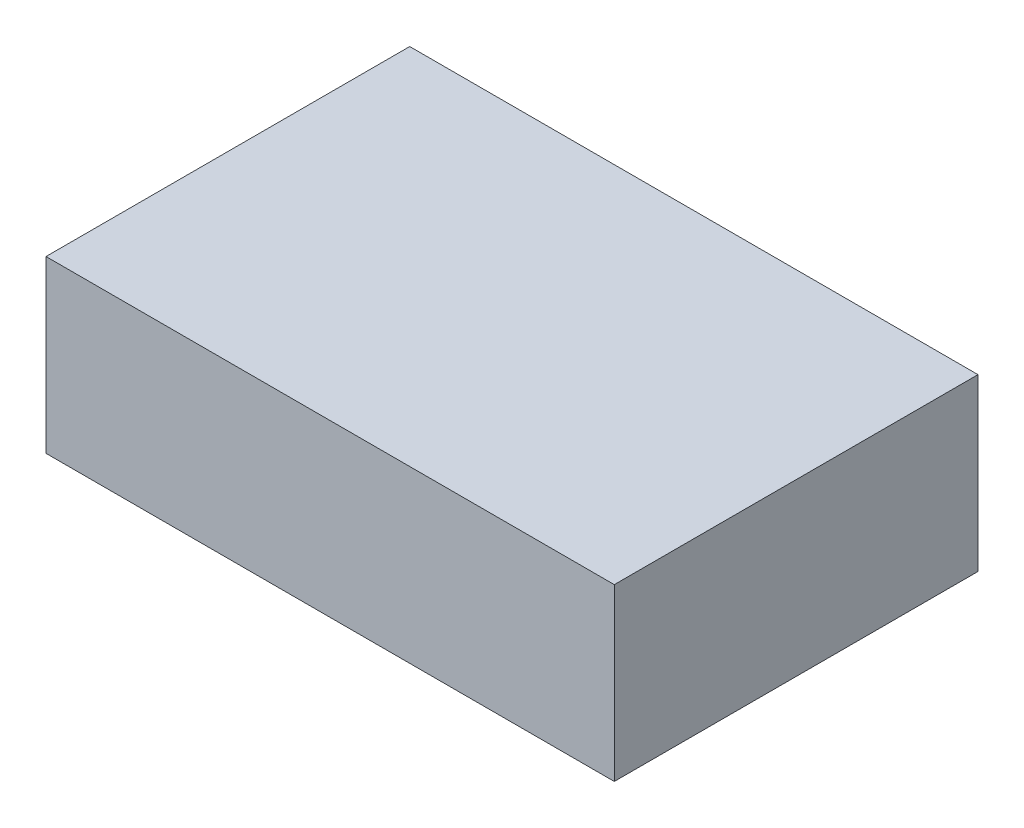
ISO-10303-21;
HEADER;
FILE_DESCRIPTION(('STEP AP214'),'2;1');
FILE_NAME('part.step','',(''),(''),'','','');
FILE_SCHEMA(('AUTOMOTIVE_DESIGN { 1 0 10303 214 1 1 1 1 }'));
ENDSEC;
DATA;
#1=APPLICATION_CONTEXT('core data for automotive mechanical design processes');
#2=APPLICATION_PROTOCOL_DEFINITION('international standard','automotive_design',2000,#1);
#3=PRODUCT_CONTEXT('',#1,'mechanical');
#4=PRODUCT('Part','Part','',(#3));
#5=PRODUCT_RELATED_PRODUCT_CATEGORY('part','',(#4));
#6=PRODUCT_DEFINITION_FORMATION('','',#4);
#7=PRODUCT_DEFINITION_CONTEXT('part definition',#1,'design');
#8=PRODUCT_DEFINITION('design','',#6,#7);
#9=PRODUCT_DEFINITION_SHAPE('','',#8);
#10=(LENGTH_UNIT() NAMED_UNIT(*) SI_UNIT(.MILLI.,.METRE.));
#11=(NAMED_UNIT(*) PLANE_ANGLE_UNIT() SI_UNIT($,.RADIAN.));
#12=(NAMED_UNIT(*) SI_UNIT($,.STERADIAN.) SOLID_ANGLE_UNIT());
#13=UNCERTAINTY_MEASURE_WITH_UNIT(LENGTH_MEASURE(1.E-05),#10,'distance_accuracy_value','');
#14=(GEOMETRIC_REPRESENTATION_CONTEXT(3) GLOBAL_UNCERTAINTY_ASSIGNED_CONTEXT((#13)) GLOBAL_UNIT_ASSIGNED_CONTEXT((#10,
#11,#12)) REPRESENTATION_CONTEXT('',''));
#15=CARTESIAN_POINT('',(0.,0.,0.));
#16=DIRECTION('',(0.,0.,1.));
#17=DIRECTION('',(1.,0.,0.));
#18=AXIS2_PLACEMENT_3D('',#15,#16,#17);
#19=CARTESIAN_POINT('',(0.,15.,-32.));
#20=DIRECTION('',(1.,0.,0.));
#21=DIRECTION('',(0.,0.,-1.));
#22=AXIS2_PLACEMENT_3D('',#19,#20,#21);
#23=PLANE('',#22);
#24=DIRECTION('',(0.,0.,1.));
#25=VECTOR('',#24,1.);
#26=CARTESIAN_POINT('',(0.,0.,-32.));
#27=LINE('',#26,#25);
#28=CARTESIAN_POINT('',(0.,0.,-32.));
#29=VERTEX_POINT('',#28);
#30=CARTESIAN_POINT('',(0.,0.,0.));
#31=VERTEX_POINT('',#30);
#32=EDGE_CURVE('E102',#29,#31,#27,.T.);
#33=ORIENTED_EDGE('',*,*,#32,.T.);
#34=DIRECTION('',(0.,-1.,0.));
#35=VECTOR('',#34,1.);
#36=CARTESIAN_POINT('',(0.,15.,0.));
#37=LINE('',#36,#35);
#38=CARTESIAN_POINT('',(0.,15.,0.));
#39=VERTEX_POINT('',#38);
#40=EDGE_CURVE('E11',#39,#31,#37,.T.);
#41=ORIENTED_EDGE('',*,*,#40,.F.);
#42=DIRECTION('',(0.,0.,1.));
#43=VECTOR('',#42,1.);
#44=CARTESIAN_POINT('',(0.,15.,-32.));
#45=LINE('',#44,#43);
#46=CARTESIAN_POINT('',(0.,15.,-32.));
#47=VERTEX_POINT('',#46);
#48=EDGE_CURVE('E90',#47,#39,#45,.T.);
#49=ORIENTED_EDGE('',*,*,#48,.F.);
#50=DIRECTION('',(0.,-1.,0.));
#51=VECTOR('',#50,1.);
#52=CARTESIAN_POINT('',(0.,15.,-32.));
#53=LINE('',#52,#51);
#54=EDGE_CURVE('E98',#47,#29,#53,.T.);
#55=ORIENTED_EDGE('',*,*,#54,.T.);
#56=EDGE_LOOP('',(#33,#41,#49,#55));
#57=FACE_BOUND('',#56,.T.);
#58=ADVANCED_FACE('F39',(#57),#23,.F.);
#59=CARTESIAN_POINT('',(0.,15.,0.));
#60=DIRECTION('',(0.,0.,-1.));
#61=DIRECTION('',(-1.,0.,0.));
#62=AXIS2_PLACEMENT_3D('',#59,#60,#61);
#63=PLANE('',#62);
#64=DIRECTION('',(1.,0.,0.));
#65=VECTOR('',#64,1.);
#66=CARTESIAN_POINT('',(0.,0.,0.));
#67=LINE('',#66,#65);
#68=CARTESIAN_POINT('',(50.,0.,0.));
#69=VERTEX_POINT('',#68);
#70=EDGE_CURVE('E94',#31,#69,#67,.T.);
#71=ORIENTED_EDGE('',*,*,#70,.T.);
#72=DIRECTION('',(0.,-1.,0.));
#73=VECTOR('',#72,1.);
#74=CARTESIAN_POINT('',(50.,15.,0.));
#75=LINE('',#74,#73);
#76=CARTESIAN_POINT('',(50.,15.,0.));
#77=VERTEX_POINT('',#76);
#78=EDGE_CURVE('E47',#77,#69,#75,.T.);
#79=ORIENTED_EDGE('',*,*,#78,.F.);
#80=DIRECTION('',(1.,0.,0.));
#81=VECTOR('',#80,1.);
#82=CARTESIAN_POINT('',(0.,15.,0.));
#83=LINE('',#82,#81);
#84=EDGE_CURVE('E85',#39,#77,#83,.T.);
#85=ORIENTED_EDGE('',*,*,#84,.F.);
#86=ORIENTED_EDGE('',*,*,#40,.T.);
#87=EDGE_LOOP('',(#71,#79,#85,#86));
#88=FACE_BOUND('',#87,.T.);
#89=ADVANCED_FACE('F93',(#88),#63,.F.);
#90=CARTESIAN_POINT('',(50.,15.,0.));
#91=DIRECTION('',(-1.,0.,0.));
#92=DIRECTION('',(0.,0.,1.));
#93=AXIS2_PLACEMENT_3D('',#90,#91,#92);
#94=PLANE('',#93);
#95=DIRECTION('',(0.,0.,-1.));
#96=VECTOR('',#95,1.);
#97=CARTESIAN_POINT('',(50.,0.,0.));
#98=LINE('',#97,#96);
#99=CARTESIAN_POINT('',(50.,0.,-32.));
#100=VERTEX_POINT('',#99);
#101=EDGE_CURVE('E72',#69,#100,#98,.T.);
#102=ORIENTED_EDGE('',*,*,#101,.T.);
#103=DIRECTION('',(0.,-1.,0.));
#104=VECTOR('',#103,1.);
#105=CARTESIAN_POINT('',(50.,15.,-32.));
#106=LINE('',#105,#104);
#107=CARTESIAN_POINT('',(50.,15.,-32.));
#108=VERTEX_POINT('',#107);
#109=EDGE_CURVE('E95',#108,#100,#106,.T.);
#110=ORIENTED_EDGE('',*,*,#109,.F.);
#111=DIRECTION('',(0.,0.,-1.));
#112=VECTOR('',#111,1.);
#113=CARTESIAN_POINT('',(50.,15.,0.));
#114=LINE('',#113,#112);
#115=EDGE_CURVE('E88',#77,#108,#114,.T.);
#116=ORIENTED_EDGE('',*,*,#115,.F.);
#117=ORIENTED_EDGE('',*,*,#78,.T.);
#118=EDGE_LOOP('',(#102,#110,#116,#117));
#119=FACE_BOUND('',#118,.T.);
#120=ADVANCED_FACE('F96',(#119),#94,.F.);
#121=CARTESIAN_POINT('',(50.,15.,-32.));
#122=DIRECTION('',(0.,0.,1.));
#123=DIRECTION('',(1.,0.,0.));
#124=AXIS2_PLACEMENT_3D('',#121,#122,#123);
#125=PLANE('',#124);
#126=DIRECTION('',(-1.,0.,0.));
#127=VECTOR('',#126,1.);
#128=CARTESIAN_POINT('',(50.,0.,-32.));
#129=LINE('',#128,#127);
#130=EDGE_CURVE('E78',#100,#29,#129,.T.);
#131=ORIENTED_EDGE('',*,*,#130,.T.);
#132=ORIENTED_EDGE('',*,*,#54,.F.);
#133=DIRECTION('',(-1.,0.,0.));
#134=VECTOR('',#133,1.);
#135=CARTESIAN_POINT('',(50.,15.,-32.));
#136=LINE('',#135,#134);
#137=EDGE_CURVE('E55',#108,#47,#136,.T.);
#138=ORIENTED_EDGE('',*,*,#137,.F.);
#139=ORIENTED_EDGE('',*,*,#109,.T.);
#140=EDGE_LOOP('',(#131,#132,#138,#139));
#141=FACE_BOUND('',#140,.T.);
#142=ADVANCED_FACE('F109',(#141),#125,.F.);
#143=CARTESIAN_POINT('',(0.,15.,0.));
#144=DIRECTION('',(0.,1.,0.));
#145=DIRECTION('',(0.,0.,1.));
#146=AXIS2_PLACEMENT_3D('',#143,#144,#145);
#147=PLANE('',#146);
#148=ORIENTED_EDGE('',*,*,#48,.T.);
#149=ORIENTED_EDGE('',*,*,#84,.T.);
#150=ORIENTED_EDGE('',*,*,#115,.T.);
#151=ORIENTED_EDGE('',*,*,#137,.T.);
#152=EDGE_LOOP('',(#148,#149,#150,#151));
#153=FACE_BOUND('',#152,.T.);
#154=ADVANCED_FACE('F86',(#153),#147,.T.);
#155=CARTESIAN_POINT('',(0.,0.,0.));
#156=DIRECTION('',(0.,1.,0.));
#157=DIRECTION('',(0.,0.,1.));
#158=AXIS2_PLACEMENT_3D('',#155,#156,#157);
#159=PLANE('',#158);
#160=ORIENTED_EDGE('',*,*,#32,.F.);
#161=ORIENTED_EDGE('',*,*,#130,.F.);
#162=ORIENTED_EDGE('',*,*,#101,.F.);
#163=ORIENTED_EDGE('',*,*,#70,.F.);
#164=EDGE_LOOP('',(#160,#161,#162,#163));
#165=FACE_BOUND('',#164,.T.);
#166=ADVANCED_FACE('F112',(#165),#159,.F.);
#167=CLOSED_SHELL('',(#58,#89,#120,#142,#154,#166));
#168=MANIFOLD_SOLID_BREP('B2',#167);
#169=ADVANCED_BREP_SHAPE_REPRESENTATION('',(#18,#168),#14);
#170=SHAPE_DEFINITION_REPRESENTATION(#9,#169);
ENDSEC;
END-ISO-10303-21;
